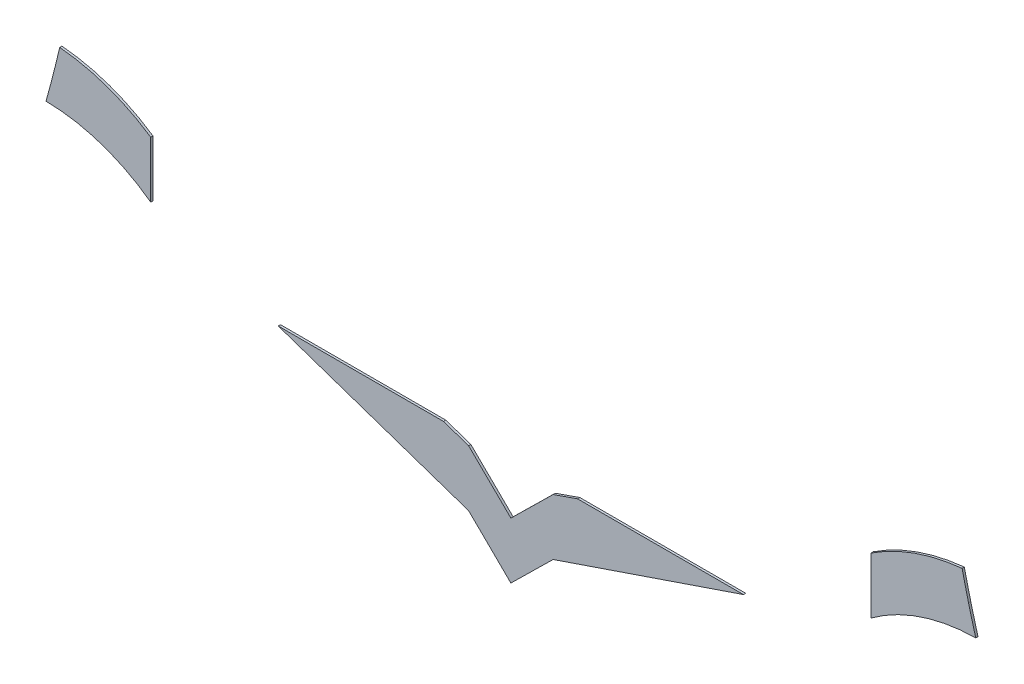
ISO-10303-21;
HEADER;
FILE_DESCRIPTION(('STEP AP214'),'2;1');
FILE_NAME('part.step','',(''),(''),'','','');
FILE_SCHEMA(('AUTOMOTIVE_DESIGN { 1 0 10303 214 1 1 1 1 }'));
ENDSEC;
DATA;
#1=APPLICATION_CONTEXT('core data for automotive mechanical design processes');
#2=APPLICATION_PROTOCOL_DEFINITION('international standard','automotive_design',2000,#1);
#3=PRODUCT_CONTEXT('',#1,'mechanical');
#4=PRODUCT('Part','Part','',(#3));
#5=PRODUCT_RELATED_PRODUCT_CATEGORY('part','',(#4));
#6=PRODUCT_DEFINITION_FORMATION('','',#4);
#7=PRODUCT_DEFINITION_CONTEXT('part definition',#1,'design');
#8=PRODUCT_DEFINITION('design','',#6,#7);
#9=PRODUCT_DEFINITION_SHAPE('','',#8);
#10=(LENGTH_UNIT() NAMED_UNIT(*) SI_UNIT(.MILLI.,.METRE.));
#11=(NAMED_UNIT(*) PLANE_ANGLE_UNIT() SI_UNIT($,.RADIAN.));
#12=(NAMED_UNIT(*) SI_UNIT($,.STERADIAN.) SOLID_ANGLE_UNIT());
#13=UNCERTAINTY_MEASURE_WITH_UNIT(LENGTH_MEASURE(1.E-05),#10,'distance_accuracy_value','');
#14=(GEOMETRIC_REPRESENTATION_CONTEXT(3) GLOBAL_UNCERTAINTY_ASSIGNED_CONTEXT((#13)) GLOBAL_UNIT_ASSIGNED_CONTEXT((#10,
#11,#12)) REPRESENTATION_CONTEXT('',''));
#15=CARTESIAN_POINT('',(0.,0.,0.));
#16=DIRECTION('',(0.,0.,1.));
#17=DIRECTION('',(1.,0.,0.));
#18=AXIS2_PLACEMENT_3D('',#15,#16,#17);
#19=CARTESIAN_POINT('',(105.255595156182,0.273340323345451,0.1));
#20=DIRECTION('',(0.,0.,-1.));
#21=DIRECTION('',(-1.,0.,0.));
#22=AXIS2_PLACEMENT_3D('',#19,#20,#21);
#23=CYLINDRICAL_SURFACE('',#22,49.5565467450276);
#24=CARTESIAN_POINT('',(105.255595156182,0.273340323345451,0.));
#25=DIRECTION('',(0.,0.,1.));
#26=DIRECTION('',(1.,0.,0.));
#27=AXIS2_PLACEMENT_3D('',#24,#25,#26);
#28=CIRCLE('',#27,49.5565467450276);
#29=CARTESIAN_POINT('',(57.2392618978318,-11.9856590532401,0.));
#30=VERTEX_POINT('',#29);
#31=CARTESIAN_POINT('',(57.5596268433982,-13.1782741521736,0.));
#32=VERTEX_POINT('',#31);
#33=EDGE_CURVE('E117',#30,#32,#28,.T.);
#34=ORIENTED_EDGE('',*,*,#33,.F.);
#35=DIRECTION('',(0.,0.,-1.));
#36=VECTOR('',#35,1.);
#37=CARTESIAN_POINT('',(57.2392618978318,-11.9856590532401,0.1));
#38=LINE('',#37,#36);
#39=CARTESIAN_POINT('',(57.2392618978318,-11.9856590532401,0.1));
#40=VERTEX_POINT('',#39);
#41=EDGE_CURVE('E12',#40,#30,#38,.T.);
#42=ORIENTED_EDGE('',*,*,#41,.F.);
#43=CARTESIAN_POINT('',(105.255595156182,0.273340323345451,0.1));
#44=DIRECTION('',(0.,0.,1.));
#45=DIRECTION('',(1.,0.,0.));
#46=AXIS2_PLACEMENT_3D('',#43,#44,#45);
#47=CIRCLE('',#46,49.5565467450276);
#48=CARTESIAN_POINT('',(57.5596268433982,-13.1782741521736,0.1));
#49=VERTEX_POINT('',#48);
#50=EDGE_CURVE('E128',#40,#49,#47,.T.);
#51=ORIENTED_EDGE('',*,*,#50,.T.);
#52=DIRECTION('',(0.,0.,-1.));
#53=VECTOR('',#52,1.);
#54=CARTESIAN_POINT('',(57.5596268433982,-13.1782741521736,0.1));
#55=LINE('',#54,#53);
#56=EDGE_CURVE('E60',#49,#32,#55,.T.);
#57=ORIENTED_EDGE('',*,*,#56,.T.);
#58=EDGE_LOOP('',(#34,#42,#51,#57));
#59=FACE_BOUND('',#58,.T.);
#60=ADVANCED_FACE('F44',(#59),#23,.F.);
#61=CARTESIAN_POINT('',(105.838872329253,0.417414248116804,0.1));
#62=DIRECTION('',(0.,0.,-1.));
#63=DIRECTION('',(-1.,0.,0.));
#64=AXIS2_PLACEMENT_3D('',#61,#62,#63);
#65=CYLINDRICAL_SURFACE('',#64,50.1573360676653);
#66=CARTESIAN_POINT('',(105.838872329253,0.417414248116804,0.));
#67=DIRECTION('',(0.,0.,1.));
#68=DIRECTION('',(1.,0.,0.));
#69=AXIS2_PLACEMENT_3D('',#66,#67,#68);
#70=CIRCLE('',#69,50.1573360676653);
#71=CARTESIAN_POINT('',(56.9528956158932,-10.803977919773,0.));
#72=VERTEX_POINT('',#71);
#73=EDGE_CURVE('E119',#72,#30,#70,.T.);
#74=ORIENTED_EDGE('',*,*,#73,.F.);
#75=DIRECTION('',(0.,0.,-1.));
#76=VECTOR('',#75,1.);
#77=CARTESIAN_POINT('',(56.9528956158932,-10.803977919773,0.1));
#78=LINE('',#77,#76);
#79=CARTESIAN_POINT('',(56.9528956158932,-10.803977919773,0.1));
#80=VERTEX_POINT('',#79);
#81=EDGE_CURVE('E52',#80,#72,#78,.T.);
#82=ORIENTED_EDGE('',*,*,#81,.F.);
#83=CARTESIAN_POINT('',(105.838872329253,0.417414248116804,0.1));
#84=DIRECTION('',(0.,0.,1.));
#85=DIRECTION('',(1.,0.,0.));
#86=AXIS2_PLACEMENT_3D('',#83,#84,#85);
#87=CIRCLE('',#86,50.1573360676653);
#88=EDGE_CURVE('E100',#80,#40,#87,.T.);
#89=ORIENTED_EDGE('',*,*,#88,.T.);
#90=ORIENTED_EDGE('',*,*,#41,.T.);
#91=EDGE_LOOP('',(#74,#82,#89,#90));
#92=FACE_BOUND('',#91,.T.);
#93=ADVANCED_FACE('F134',(#92),#65,.F.);
#94=CARTESIAN_POINT('',(57.8516246009615,-19.7603169013723,0.1));
#95=DIRECTION('',(0.,0.,-1.));
#96=DIRECTION('',(-1.,0.,0.));
#97=AXIS2_PLACEMENT_3D('',#94,#95,#96);
#98=CYLINDRICAL_SURFACE('',#97,9.00131777807657);
#99=CARTESIAN_POINT('',(57.8516246009615,-19.7603169013723,0.));
#100=DIRECTION('',(0.,0.,1.));
#101=DIRECTION('',(1.,0.,0.));
#102=AXIS2_PLACEMENT_3D('',#99,#100,#101);
#103=CIRCLE('',#102,9.00131777807657);
#104=CARTESIAN_POINT('',(52.9070512570531,-12.2386870122706,0.));
#105=VERTEX_POINT('',#104);
#106=EDGE_CURVE('E107',#72,#105,#103,.T.);
#107=ORIENTED_EDGE('',*,*,#106,.T.);
#108=DIRECTION('',(0.,0.,-1.));
#109=VECTOR('',#108,1.);
#110=CARTESIAN_POINT('',(52.9070512570531,-12.2386870122706,0.1));
#111=LINE('',#110,#109);
#112=CARTESIAN_POINT('',(52.9070512570531,-12.2386870122706,0.1));
#113=VERTEX_POINT('',#112);
#114=EDGE_CURVE('E104',#113,#105,#111,.T.);
#115=ORIENTED_EDGE('',*,*,#114,.F.);
#116=CARTESIAN_POINT('',(57.8516246009615,-19.7603169013723,0.1));
#117=DIRECTION('',(0.,0.,1.));
#118=DIRECTION('',(1.,0.,0.));
#119=AXIS2_PLACEMENT_3D('',#116,#117,#118);
#120=CIRCLE('',#119,9.00131777807657);
#121=EDGE_CURVE('E93',#80,#113,#120,.T.);
#122=ORIENTED_EDGE('',*,*,#121,.F.);
#123=ORIENTED_EDGE('',*,*,#81,.T.);
#124=EDGE_LOOP('',(#107,#115,#122,#123));
#125=FACE_BOUND('',#124,.T.);
#126=ADVANCED_FACE('F105',(#125),#98,.T.);
#127=CARTESIAN_POINT('',(52.9070512570531,0.,0.1));
#128=DIRECTION('',(1.,0.,0.));
#129=DIRECTION('',(0.,0.,-1.));
#130=AXIS2_PLACEMENT_3D('',#127,#128,#129);
#131=PLANE('',#130);
#132=DIRECTION('',(0.,-1.,0.));
#133=VECTOR('',#132,1.);
#134=CARTESIAN_POINT('',(52.9070512570531,0.,0.));
#135=LINE('',#134,#133);
#136=CARTESIAN_POINT('',(52.9070512570531,-14.7408716116207,0.));
#137=VERTEX_POINT('',#136);
#138=EDGE_CURVE('E123',#105,#137,#135,.T.);
#139=ORIENTED_EDGE('',*,*,#138,.T.);
#140=DIRECTION('',(0.,0.,-1.));
#141=VECTOR('',#140,1.);
#142=CARTESIAN_POINT('',(52.9070512570531,-14.7408716116207,0.1));
#143=LINE('',#142,#141);
#144=CARTESIAN_POINT('',(52.9070512570531,-14.7408716116207,0.1));
#145=VERTEX_POINT('',#144);
#146=EDGE_CURVE('E77',#145,#137,#143,.T.);
#147=ORIENTED_EDGE('',*,*,#146,.F.);
#148=DIRECTION('',(0.,-1.,0.));
#149=VECTOR('',#148,1.);
#150=CARTESIAN_POINT('',(52.9070512570531,0.,0.1));
#151=LINE('',#150,#149);
#152=EDGE_CURVE('E98',#113,#145,#151,.T.);
#153=ORIENTED_EDGE('',*,*,#152,.F.);
#154=ORIENTED_EDGE('',*,*,#114,.T.);
#155=EDGE_LOOP('',(#139,#147,#153,#154));
#156=FACE_BOUND('',#155,.T.);
#157=ADVANCED_FACE('F111',(#156),#131,.F.);
#158=CARTESIAN_POINT('',(57.655479277362,-21.1714049627363,0.1));
#159=DIRECTION('',(0.,0.,-1.));
#160=DIRECTION('',(-1.,0.,0.));
#161=AXIS2_PLACEMENT_3D('',#158,#159,#160);
#162=CYLINDRICAL_SURFACE('',#161,7.99370551395687);
#163=CARTESIAN_POINT('',(57.655479277362,-21.1714049627363,0.));
#164=DIRECTION('',(0.,0.,1.));
#165=DIRECTION('',(1.,0.,0.));
#166=AXIS2_PLACEMENT_3D('',#163,#164,#165);
#167=CIRCLE('',#166,7.99370551395687);
#168=EDGE_CURVE('E125',#32,#137,#167,.T.);
#169=ORIENTED_EDGE('',*,*,#168,.F.);
#170=ORIENTED_EDGE('',*,*,#56,.F.);
#171=CARTESIAN_POINT('',(57.655479277362,-21.1714049627363,0.1));
#172=DIRECTION('',(0.,0.,1.));
#173=DIRECTION('',(1.,0.,0.));
#174=AXIS2_PLACEMENT_3D('',#171,#172,#173);
#175=CIRCLE('',#174,7.99370551395687);
#176=EDGE_CURVE('E112',#49,#145,#175,.T.);
#177=ORIENTED_EDGE('',*,*,#176,.T.);
#178=ORIENTED_EDGE('',*,*,#146,.T.);
#179=EDGE_LOOP('',(#169,#170,#177,#178));
#180=FACE_BOUND('',#179,.T.);
#181=ADVANCED_FACE('F135',(#180),#162,.F.);
#182=CARTESIAN_POINT('',(0.,0.,0.1));
#183=DIRECTION('',(0.,0.,1.));
#184=DIRECTION('',(1.,0.,0.));
#185=AXIS2_PLACEMENT_3D('',#182,#183,#184);
#186=PLANE('',#185);
#187=ORIENTED_EDGE('',*,*,#50,.F.);
#188=ORIENTED_EDGE('',*,*,#88,.F.);
#189=ORIENTED_EDGE('',*,*,#121,.T.);
#190=ORIENTED_EDGE('',*,*,#152,.T.);
#191=ORIENTED_EDGE('',*,*,#176,.F.);
#192=EDGE_LOOP('',(#187,#188,#189,#190,#191));
#193=FACE_BOUND('',#192,.T.);
#194=ADVANCED_FACE('F95',(#193),#186,.T.);
#195=CARTESIAN_POINT('',(0.,0.,0.));
#196=DIRECTION('',(0.,0.,1.));
#197=DIRECTION('',(1.,0.,0.));
#198=AXIS2_PLACEMENT_3D('',#195,#196,#197);
#199=PLANE('',#198);
#200=ORIENTED_EDGE('',*,*,#33,.T.);
#201=ORIENTED_EDGE('',*,*,#168,.T.);
#202=ORIENTED_EDGE('',*,*,#138,.F.);
#203=ORIENTED_EDGE('',*,*,#106,.F.);
#204=ORIENTED_EDGE('',*,*,#73,.T.);
#205=EDGE_LOOP('',(#200,#201,#202,#203,#204));
#206=FACE_BOUND('',#205,.T.);
#207=ADVANCED_FACE('F133',(#206),#199,.F.);
#208=CLOSED_SHELL('',(#60,#93,#126,#157,#181,#194,#207));
#209=MANIFOLD_SOLID_BREP('B2',#208);
#210=CARTESIAN_POINT('',(9.99420137721838,-29.3523144183627,0.1));
#211=DIRECTION('',(0.322319407031815,-0.946630973426635,0.));
#212=DIRECTION('',(0.946630973426635,0.322319407031815,0.));
#213=AXIS2_PLACEMENT_3D('',#210,#211,#212);
#214=PLANE('',#213);
#215=DIRECTION('',(-0.946630973426636,-0.322319407031815,0.));
#216=VECTOR('',#215,1.);
#217=CARTESIAN_POINT('',(9.99420137721838,-29.3523144183627,0.));
#218=LINE('',#217,#216);
#219=CARTESIAN_POINT('',(47.2390911432918,-16.6707614992658,0.));
#220=VERTEX_POINT('',#219);
#221=CARTESIAN_POINT('',(38.7822885700879,-19.550227381217,0.));
#222=VERTEX_POINT('',#221);
#223=EDGE_CURVE('E309',#220,#222,#218,.T.);
#224=ORIENTED_EDGE('',*,*,#223,.F.);
#225=DIRECTION('',(0.,0.,-1.));
#226=VECTOR('',#225,1.);
#227=CARTESIAN_POINT('',(47.2390911432918,-16.6707614992658,0.1));
#228=LINE('',#227,#226);
#229=CARTESIAN_POINT('',(47.2390911432918,-16.6707614992658,0.1));
#230=VERTEX_POINT('',#229);
#231=EDGE_CURVE('E42',#230,#220,#228,.T.);
#232=ORIENTED_EDGE('',*,*,#231,.F.);
#233=DIRECTION('',(-0.946630973426636,-0.322319407031815,0.));
#234=VECTOR('',#233,1.);
#235=CARTESIAN_POINT('',(9.99420137721838,-29.3523144183627,0.1));
#236=LINE('',#235,#234);
#237=CARTESIAN_POINT('',(38.7822885700879,-19.550227381217,0.1));
#238=VERTEX_POINT('',#237);
#239=EDGE_CURVE('E329',#230,#238,#236,.T.);
#240=ORIENTED_EDGE('',*,*,#239,.T.);
#241=DIRECTION('',(0.,0.,-1.));
#242=VECTOR('',#241,1.);
#243=CARTESIAN_POINT('',(38.7822885700879,-19.550227381217,0.1));
#244=LINE('',#243,#242);
#245=EDGE_CURVE('E219',#238,#222,#244,.T.);
#246=ORIENTED_EDGE('',*,*,#245,.T.);
#247=EDGE_LOOP('',(#224,#232,#240,#246));
#248=FACE_BOUND('',#247,.T.);
#249=ADVANCED_FACE('F203',(#248),#214,.T.);
#250=CARTESIAN_POINT('',(0.,-16.6707614992658,0.1));
#251=DIRECTION('',(0.,-1.,0.));
#252=DIRECTION('',(1.,0.,0.));
#253=AXIS2_PLACEMENT_3D('',#250,#251,#252);
#254=PLANE('',#253);
#255=DIRECTION('',(-1.,0.,0.));
#256=VECTOR('',#255,1.);
#257=CARTESIAN_POINT('',(0.,-16.6707614992658,0.));
#258=LINE('',#257,#256);
#259=CARTESIAN_POINT('',(39.8707967665325,-16.6707614992658,0.));
#260=VERTEX_POINT('',#259);
#261=EDGE_CURVE('E311',#220,#260,#258,.T.);
#262=ORIENTED_EDGE('',*,*,#261,.T.);
#263=DIRECTION('',(0.,0.,-1.));
#264=VECTOR('',#263,1.);
#265=CARTESIAN_POINT('',(39.8707967665325,-16.6707614992658,0.1));
#266=LINE('',#265,#264);
#267=CARTESIAN_POINT('',(39.8707967665325,-16.6707614992658,0.1));
#268=VERTEX_POINT('',#267);
#269=EDGE_CURVE('E211',#268,#260,#266,.T.);
#270=ORIENTED_EDGE('',*,*,#269,.F.);
#271=DIRECTION('',(-1.,0.,0.));
#272=VECTOR('',#271,1.);
#273=CARTESIAN_POINT('',(0.,-16.6707614992658,0.1));
#274=LINE('',#273,#272);
#275=EDGE_CURVE('E376',#230,#268,#274,.T.);
#276=ORIENTED_EDGE('',*,*,#275,.F.);
#277=ORIENTED_EDGE('',*,*,#231,.T.);
#278=EDGE_LOOP('',(#262,#270,#276,#277));
#279=FACE_BOUND('',#278,.T.);
#280=ADVANCED_FACE('F389',(#279),#254,.F.);
#281=CARTESIAN_POINT('',(9.50228331858357,-27.257557976051,0.1));
#282=DIRECTION('',(0.329181682712165,-0.944266604178496,0.));
#283=DIRECTION('',(0.944266604178496,0.329181682712165,0.));
#284=AXIS2_PLACEMENT_3D('',#281,#282,#283);
#285=PLANE('',#284);
#286=DIRECTION('',(-0.944266604178496,-0.329181682712165,0.));
#287=VECTOR('',#286,1.);
#288=CARTESIAN_POINT('',(9.50228331858357,-27.257557976051,0.));
#289=LINE('',#288,#287);
#290=CARTESIAN_POINT('',(38.7822885700879,-17.050227381217,0.));
#291=VERTEX_POINT('',#290);
#292=EDGE_CURVE('E313',#260,#291,#289,.T.);
#293=ORIENTED_EDGE('',*,*,#292,.T.);
#294=DIRECTION('',(0.,0.,-1.));
#295=VECTOR('',#294,1.);
#296=CARTESIAN_POINT('',(38.7822885700879,-17.050227381217,0.1));
#297=LINE('',#296,#295);
#298=CARTESIAN_POINT('',(38.7822885700879,-17.050227381217,0.1));
#299=VERTEX_POINT('',#298);
#300=EDGE_CURVE('E342',#299,#291,#297,.T.);
#301=ORIENTED_EDGE('',*,*,#300,.F.);
#302=DIRECTION('',(-0.944266604178496,-0.329181682712165,0.));
#303=VECTOR('',#302,1.);
#304=CARTESIAN_POINT('',(9.50228331858357,-27.257557976051,0.1));
#305=LINE('',#304,#303);
#306=EDGE_CURVE('E351',#268,#299,#305,.T.);
#307=ORIENTED_EDGE('',*,*,#306,.F.);
#308=ORIENTED_EDGE('',*,*,#269,.T.);
#309=EDGE_LOOP('',(#293,#301,#307,#308));
#310=FACE_BOUND('',#309,.T.);
#311=ADVANCED_FACE('F349',(#310),#285,.F.);
#312=CARTESIAN_POINT('',(27.5878765181608,-28.0573337595043,0.1));
#313=DIRECTION('',(0.701116242134741,-0.713046993552921,0.));
#314=DIRECTION('',(0.713046993552921,0.701116242134741,0.));
#315=AXIS2_PLACEMENT_3D('',#312,#313,#314);
#316=PLANE('',#315);
#317=DIRECTION('',(-0.713046993552921,-0.701116242134741,0.));
#318=VECTOR('',#317,1.);
#319=CARTESIAN_POINT('',(27.5878765181608,-28.0573337595043,0.));
#320=LINE('',#319,#318);
#321=CARTESIAN_POINT('',(36.9069299269056,-18.8942073943874,0.));
#322=VERTEX_POINT('',#321);
#323=EDGE_CURVE('E315',#291,#322,#320,.T.);
#324=ORIENTED_EDGE('',*,*,#323,.T.);
#325=DIRECTION('',(0.,0.,-1.));
#326=VECTOR('',#325,1.);
#327=CARTESIAN_POINT('',(36.9069299269056,-18.8942073943874,0.1));
#328=LINE('',#327,#326);
#329=CARTESIAN_POINT('',(36.9069299269056,-18.8942073943874,0.1));
#330=VERTEX_POINT('',#329);
#331=EDGE_CURVE('E339',#330,#322,#328,.T.);
#332=ORIENTED_EDGE('',*,*,#331,.F.);
#333=DIRECTION('',(-0.713046993552921,-0.701116242134741,0.));
#334=VECTOR('',#333,1.);
#335=CARTESIAN_POINT('',(27.5878765181608,-28.0573337595043,0.1));
#336=LINE('',#335,#334);
#337=EDGE_CURVE('E370',#299,#330,#336,.T.);
#338=ORIENTED_EDGE('',*,*,#337,.F.);
#339=ORIENTED_EDGE('',*,*,#300,.T.);
#340=EDGE_LOOP('',(#324,#332,#338,#339));
#341=FACE_BOUND('',#340,.T.);
#342=ADVANCED_FACE('F361',(#341),#316,.F.);
#343=CARTESIAN_POINT('',(8.6928837462616,8.84248874565546,0.1));
#344=DIRECTION('',(-0.701048506646403,-0.713113589359261,0.));
#345=DIRECTION('',(0.713113589359261,-0.701048506646403,0.));
#346=AXIS2_PLACEMENT_3D('',#343,#344,#345);
#347=PLANE('',#346);
#348=DIRECTION('',(-0.713113589359261,0.701048506646403,0.));
#349=VECTOR('',#348,1.);
#350=CARTESIAN_POINT('',(8.6928837462616,8.84248874565546,0.));
#351=LINE('',#350,#349);
#352=CARTESIAN_POINT('',(35.0313961325451,-17.0504055298308,0.));
#353=VERTEX_POINT('',#352);
#354=EDGE_CURVE('E317',#322,#353,#351,.T.);
#355=ORIENTED_EDGE('',*,*,#354,.T.);
#356=DIRECTION('',(0.,0.,-1.));
#357=VECTOR('',#356,1.);
#358=CARTESIAN_POINT('',(35.0313961325451,-17.0504055298308,0.1));
#359=LINE('',#358,#357);
#360=CARTESIAN_POINT('',(35.0313961325451,-17.0504055298308,0.1));
#361=VERTEX_POINT('',#360);
#362=EDGE_CURVE('E336',#361,#353,#359,.T.);
#363=ORIENTED_EDGE('',*,*,#362,.F.);
#364=DIRECTION('',(-0.713113589359261,0.701048506646403,0.));
#365=VECTOR('',#364,1.);
#366=CARTESIAN_POINT('',(8.6928837462616,8.84248874565546,0.1));
#367=LINE('',#366,#365);
#368=EDGE_CURVE('E367',#330,#361,#367,.T.);
#369=ORIENTED_EDGE('',*,*,#368,.F.);
#370=ORIENTED_EDGE('',*,*,#331,.T.);
#371=EDGE_LOOP('',(#355,#363,#369,#370));
#372=FACE_BOUND('',#371,.T.);
#373=ADVANCED_FACE('F365',(#372),#347,.F.);
#374=CARTESIAN_POINT('',(-1.56372014546052,-4.59397374162848,0.1));
#375=DIRECTION('',(-0.322229485113041,-0.946661586272404,0.));
#376=DIRECTION('',(0.946661586272404,-0.322229485113041,0.));
#377=AXIS2_PLACEMENT_3D('',#374,#375,#376);
#378=PLANE('',#377);
#379=DIRECTION('',(-0.946661586272404,0.322229485113041,0.));
#380=VECTOR('',#379,1.);
#381=CARTESIAN_POINT('',(-1.56372014546052,-4.59397374162848,0.));
#382=LINE('',#381,#380);
#383=CARTESIAN_POINT('',(33.9160592785405,-16.6707614992658,0.));
#384=VERTEX_POINT('',#383);
#385=EDGE_CURVE('E319',#353,#384,#382,.T.);
#386=ORIENTED_EDGE('',*,*,#385,.T.);
#387=DIRECTION('',(0.,0.,-1.));
#388=VECTOR('',#387,1.);
#389=CARTESIAN_POINT('',(33.9160592785405,-16.6707614992658,0.1));
#390=LINE('',#389,#388);
#391=CARTESIAN_POINT('',(33.9160592785405,-16.6707614992658,0.1));
#392=VERTEX_POINT('',#391);
#393=EDGE_CURVE('E333',#392,#384,#390,.T.);
#394=ORIENTED_EDGE('',*,*,#393,.F.);
#395=DIRECTION('',(-0.946661586272404,0.322229485113041,0.));
#396=VECTOR('',#395,1.);
#397=CARTESIAN_POINT('',(-1.56372014546052,-4.59397374162848,0.1));
#398=LINE('',#397,#396);
#399=EDGE_CURVE('E369',#361,#392,#398,.T.);
#400=ORIENTED_EDGE('',*,*,#399,.F.);
#401=ORIENTED_EDGE('',*,*,#362,.T.);
#402=EDGE_LOOP('',(#386,#394,#400,#401));
#403=FACE_BOUND('',#402,.T.);
#404=ADVANCED_FACE('F402',(#403),#378,.F.);
#405=CARTESIAN_POINT('',(0.,-16.6707614992658,0.1));
#406=DIRECTION('',(0.,-1.,0.));
#407=DIRECTION('',(0.,0.,-1.));
#408=AXIS2_PLACEMENT_3D('',#405,#406,#407);
#409=PLANE('',#408);
#410=DIRECTION('',(-1.,0.,0.));
#411=VECTOR('',#410,1.);
#412=CARTESIAN_POINT('',(0.,-16.6707614992658,0.));
#413=LINE('',#412,#411);
#414=CARTESIAN_POINT('',(26.5716741651286,-16.6707614992658,0.));
#415=VERTEX_POINT('',#414);
#416=EDGE_CURVE('E321',#384,#415,#413,.T.);
#417=ORIENTED_EDGE('',*,*,#416,.T.);
#418=DIRECTION('',(0.,0.,-1.));
#419=VECTOR('',#418,1.);
#420=CARTESIAN_POINT('',(26.5716741651286,-16.6707614992658,0.1));
#421=LINE('',#420,#419);
#422=CARTESIAN_POINT('',(26.5716741651286,-16.6707614992658,0.1));
#423=VERTEX_POINT('',#422);
#424=EDGE_CURVE('E301',#423,#415,#421,.T.);
#425=ORIENTED_EDGE('',*,*,#424,.F.);
#426=DIRECTION('',(-1.,0.,0.));
#427=VECTOR('',#426,1.);
#428=CARTESIAN_POINT('',(0.,-16.6707614992658,0.1));
#429=LINE('',#428,#427);
#430=EDGE_CURVE('E289',#392,#423,#429,.T.);
#431=ORIENTED_EDGE('',*,*,#430,.F.);
#432=ORIENTED_EDGE('',*,*,#393,.T.);
#433=EDGE_LOOP('',(#417,#425,#431,#432));
#434=FACE_BOUND('',#433,.T.);
#435=ADVANCED_FACE('F405',(#434),#409,.F.);
#436=CARTESIAN_POINT('',(-2.32630117335883,-6.83432168892512,0.1));
#437=DIRECTION('',(0.32222948511304,0.946661586272404,0.));
#438=DIRECTION('',(-0.946661586272405,0.32222948511304,0.));
#439=AXIS2_PLACEMENT_3D('',#436,#437,#438);
#440=PLANE('',#439);
#441=DIRECTION('',(0.946661586272404,-0.32222948511304,0.));
#442=VECTOR('',#441,1.);
#443=CARTESIAN_POINT('',(-2.32630117335883,-6.83432168892512,0.));
#444=LINE('',#443,#442);
#445=CARTESIAN_POINT('',(35.0316336075146,-19.5504055185519,0.));
#446=VERTEX_POINT('',#445);
#447=EDGE_CURVE('E298',#415,#446,#444,.T.);
#448=ORIENTED_EDGE('',*,*,#447,.T.);
#449=DIRECTION('',(0.,0.,-1.));
#450=VECTOR('',#449,1.);
#451=CARTESIAN_POINT('',(35.0316336075146,-19.5504055185519,0.1));
#452=LINE('',#451,#450);
#453=CARTESIAN_POINT('',(35.0316336075146,-19.5504055185519,0.1));
#454=VERTEX_POINT('',#453);
#455=EDGE_CURVE('E295',#454,#446,#452,.T.);
#456=ORIENTED_EDGE('',*,*,#455,.F.);
#457=DIRECTION('',(0.946661586272404,-0.32222948511304,0.));
#458=VECTOR('',#457,1.);
#459=CARTESIAN_POINT('',(-2.32630117335883,-6.83432168892512,0.1));
#460=LINE('',#459,#458);
#461=EDGE_CURVE('E281',#423,#454,#460,.T.);
#462=ORIENTED_EDGE('',*,*,#461,.F.);
#463=ORIENTED_EDGE('',*,*,#424,.T.);
#464=EDGE_LOOP('',(#448,#456,#462,#463));
#465=FACE_BOUND('',#464,.T.);
#466=ADVANCED_FACE('F296',(#465),#440,.F.);
#467=CARTESIAN_POINT('',(7.44318242126414,7.57127999326957,0.1));
#468=DIRECTION('',(0.701048506646403,0.713113589359261,0.));
#469=DIRECTION('',(-0.713113589359261,0.701048506646403,0.));
#470=AXIS2_PLACEMENT_3D('',#467,#468,#469);
#471=PLANE('',#470);
#472=DIRECTION('',(0.713113589359261,-0.701048506646403,0.));
#473=VECTOR('',#472,1.);
#474=CARTESIAN_POINT('',(7.44318242126414,7.57127999326957,0.));
#475=LINE('',#474,#473);
#476=CARTESIAN_POINT('',(36.9071674018751,-21.3942073831086,0.));
#477=VERTEX_POINT('',#476);
#478=EDGE_CURVE('E324',#446,#477,#475,.T.);
#479=ORIENTED_EDGE('',*,*,#478,.T.);
#480=DIRECTION('',(0.,0.,-1.));
#481=VECTOR('',#480,1.);
#482=CARTESIAN_POINT('',(36.9071674018751,-21.3942073831086,0.1));
#483=LINE('',#482,#481);
#484=CARTESIAN_POINT('',(36.9071674018751,-21.3942073831086,0.1));
#485=VERTEX_POINT('',#484);
#486=EDGE_CURVE('E251',#485,#477,#483,.T.);
#487=ORIENTED_EDGE('',*,*,#486,.F.);
#488=DIRECTION('',(0.713113589359261,-0.701048506646403,0.));
#489=VECTOR('',#488,1.);
#490=CARTESIAN_POINT('',(7.44318242126414,7.57127999326957,0.1));
#491=LINE('',#490,#489);
#492=EDGE_CURVE('E287',#454,#485,#491,.T.);
#493=ORIENTED_EDGE('',*,*,#492,.F.);
#494=ORIENTED_EDGE('',*,*,#455,.T.);
#495=EDGE_LOOP('',(#479,#487,#493,#494));
#496=FACE_BOUND('',#495,.T.);
#497=ADVANCED_FACE('F303',(#496),#471,.F.);
#498=CARTESIAN_POINT('',(28.840174219251,-29.3272275827219,0.1));
#499=DIRECTION('',(0.701161381277546,-0.713002606871086,0.));
#500=DIRECTION('',(0.713002606871086,0.701161381277546,0.));
#501=AXIS2_PLACEMENT_3D('',#498,#499,#500);
#502=PLANE('',#501);
#503=DIRECTION('',(-0.713002606871086,-0.701161381277546,0.));
#504=VECTOR('',#503,1.);
#505=CARTESIAN_POINT('',(28.840174219251,-29.3272275827219,0.));
#506=LINE('',#505,#504);
#507=EDGE_CURVE('E326',#222,#477,#506,.T.);
#508=ORIENTED_EDGE('',*,*,#507,.F.);
#509=ORIENTED_EDGE('',*,*,#245,.F.);
#510=DIRECTION('',(-0.713002606871086,-0.701161381277546,0.));
#511=VECTOR('',#510,1.);
#512=CARTESIAN_POINT('',(28.840174219251,-29.3272275827219,0.1));
#513=LINE('',#512,#511);
#514=EDGE_CURVE('E304',#238,#485,#513,.T.);
#515=ORIENTED_EDGE('',*,*,#514,.T.);
#516=ORIENTED_EDGE('',*,*,#486,.T.);
#517=EDGE_LOOP('',(#508,#509,#515,#516));
#518=FACE_BOUND('',#517,.T.);
#519=ADVANCED_FACE('F378',(#518),#502,.T.);
#520=CARTESIAN_POINT('',(0.,0.,0.1));
#521=DIRECTION('',(0.,0.,1.));
#522=DIRECTION('',(1.,0.,0.));
#523=AXIS2_PLACEMENT_3D('',#520,#521,#522);
#524=PLANE('',#523);
#525=ORIENTED_EDGE('',*,*,#239,.F.);
#526=ORIENTED_EDGE('',*,*,#275,.T.);
#527=ORIENTED_EDGE('',*,*,#306,.T.);
#528=ORIENTED_EDGE('',*,*,#337,.T.);
#529=ORIENTED_EDGE('',*,*,#368,.T.);
#530=ORIENTED_EDGE('',*,*,#399,.T.);
#531=ORIENTED_EDGE('',*,*,#430,.T.);
#532=ORIENTED_EDGE('',*,*,#461,.T.);
#533=ORIENTED_EDGE('',*,*,#492,.T.);
#534=ORIENTED_EDGE('',*,*,#514,.F.);
#535=EDGE_LOOP('',(#525,#526,#527,#528,#529,#530,#531,#532,#533,#534));
#536=FACE_BOUND('',#535,.T.);
#537=ADVANCED_FACE('F284',(#536),#524,.T.);
#538=CARTESIAN_POINT('',(0.,0.,0.));
#539=DIRECTION('',(0.,0.,1.));
#540=DIRECTION('',(1.,0.,0.));
#541=AXIS2_PLACEMENT_3D('',#538,#539,#540);
#542=PLANE('',#541);
#543=ORIENTED_EDGE('',*,*,#223,.T.);
#544=ORIENTED_EDGE('',*,*,#507,.T.);
#545=ORIENTED_EDGE('',*,*,#478,.F.);
#546=ORIENTED_EDGE('',*,*,#447,.F.);
#547=ORIENTED_EDGE('',*,*,#416,.F.);
#548=ORIENTED_EDGE('',*,*,#385,.F.);
#549=ORIENTED_EDGE('',*,*,#354,.F.);
#550=ORIENTED_EDGE('',*,*,#323,.F.);
#551=ORIENTED_EDGE('',*,*,#292,.F.);
#552=ORIENTED_EDGE('',*,*,#261,.F.);
#553=EDGE_LOOP('',(#543,#544,#545,#546,#547,#548,#549,#550,#551,#552));
#554=FACE_BOUND('',#553,.T.);
#555=ADVANCED_FACE('F356',(#554),#542,.F.);
#556=CLOSED_SHELL('',(#249,#280,#311,#342,#373,#404,#435,#466,#497,#519,#537,#555));
#557=MANIFOLD_SOLID_BREP('B6',#556);
#558=CARTESIAN_POINT('',(-32.4832290074629,0.585922876906455,0.1));
#559=DIRECTION('',(0.,0.,-1.));
#560=DIRECTION('',(-1.,0.,0.));
#561=AXIS2_PLACEMENT_3D('',#558,#559,#560);
#562=CYLINDRICAL_SURFACE('',#561,50.6437994061064);
#563=CARTESIAN_POINT('',(-32.4832290074629,0.585922876906455,0.));
#564=DIRECTION('',(0.,0.,1.));
#565=DIRECTION('',(1.,0.,0.));
#566=AXIS2_PLACEMENT_3D('',#563,#564,#565);
#567=CIRCLE('',#566,50.6437994061064);
#568=CARTESIAN_POINT('',(16.2536901471598,-13.1802359773895,0.));
#569=VERTEX_POINT('',#568);
#570=CARTESIAN_POINT('',(16.8626582068563,-10.806084554518,0.));
#571=VERTEX_POINT('',#570);
#572=EDGE_CURVE('E546',#569,#571,#567,.T.);
#573=ORIENTED_EDGE('',*,*,#572,.F.);
#574=DIRECTION('',(0.,0.,-1.));
#575=VECTOR('',#574,1.);
#576=CARTESIAN_POINT('',(16.2536901471598,-13.1802359773895,0.1));
#577=LINE('',#576,#575);
#578=CARTESIAN_POINT('',(16.2536901471598,-13.1802359773895,0.1));
#579=VERTEX_POINT('',#578);
#580=EDGE_CURVE('E201',#579,#569,#577,.T.);
#581=ORIENTED_EDGE('',*,*,#580,.F.);
#582=CARTESIAN_POINT('',(-32.4832290074629,0.585922876906455,0.1));
#583=DIRECTION('',(0.,0.,1.));
#584=DIRECTION('',(1.,0.,0.));
#585=AXIS2_PLACEMENT_3D('',#582,#583,#584);
#586=CIRCLE('',#585,50.6437994061064);
#587=CARTESIAN_POINT('',(16.8626582068563,-10.806084554518,0.1));
#588=VERTEX_POINT('',#587);
#589=EDGE_CURVE('E540',#579,#588,#586,.T.);
#590=ORIENTED_EDGE('',*,*,#589,.T.);
#591=DIRECTION('',(0.,0.,-1.));
#592=VECTOR('',#591,1.);
#593=CARTESIAN_POINT('',(16.8626582068563,-10.806084554518,0.1));
#594=LINE('',#593,#592);
#595=EDGE_CURVE('E521',#588,#571,#594,.T.);
#596=ORIENTED_EDGE('',*,*,#595,.T.);
#597=EDGE_LOOP('',(#573,#581,#590,#596));
#598=FACE_BOUND('',#597,.T.);
#599=ADVANCED_FACE('F483',(#598),#562,.F.);
#600=CARTESIAN_POINT('',(16.1585969810265,-21.1733758569124,0.1));
#601=DIRECTION('',(0.,0.,-1.));
#602=DIRECTION('',(-1.,0.,0.));
#603=AXIS2_PLACEMENT_3D('',#600,#601,#602);
#604=CYLINDRICAL_SURFACE('',#603,7.99370551395687);
#605=CARTESIAN_POINT('',(16.1585969810265,-21.1733758569124,0.));
#606=DIRECTION('',(0.,0.,1.));
#607=DIRECTION('',(1.,0.,0.));
#608=AXIS2_PLACEMENT_3D('',#605,#606,#607);
#609=CIRCLE('',#608,7.99370551395687);
#610=CARTESIAN_POINT('',(20.9064141436281,-14.7423914816888,0.));
#611=VERTEX_POINT('',#610);
#612=EDGE_CURVE('E534',#611,#569,#609,.T.);
#613=ORIENTED_EDGE('',*,*,#612,.F.);
#614=DIRECTION('',(0.,0.,-1.));
#615=VECTOR('',#614,1.);
#616=CARTESIAN_POINT('',(20.9064141436281,-14.7423914816888,0.1));
#617=LINE('',#616,#615);
#618=CARTESIAN_POINT('',(20.9064141436281,-14.7423914816888,0.1));
#619=VERTEX_POINT('',#618);
#620=EDGE_CURVE('E491',#619,#611,#617,.T.);
#621=ORIENTED_EDGE('',*,*,#620,.F.);
#622=CARTESIAN_POINT('',(16.1585969810265,-21.1733758569124,0.1));
#623=DIRECTION('',(0.,0.,1.));
#624=DIRECTION('',(1.,0.,0.));
#625=AXIS2_PLACEMENT_3D('',#622,#623,#624);
#626=CIRCLE('',#625,7.99370551395687);
#627=EDGE_CURVE('E532',#619,#579,#626,.T.);
#628=ORIENTED_EDGE('',*,*,#627,.T.);
#629=ORIENTED_EDGE('',*,*,#580,.T.);
#630=EDGE_LOOP('',(#613,#621,#628,#629));
#631=FACE_BOUND('',#630,.T.);
#632=ADVANCED_FACE('F530',(#631),#604,.F.);
#633=CARTESIAN_POINT('',(20.9050135754069,0.00198576699332894,0.1));
#634=DIRECTION('',(-0.999999995488451,-9.49899877944187E-05,0.));
#635=DIRECTION('',(9.49899877944187E-05,-0.999999995488451,0.));
#636=AXIS2_PLACEMENT_3D('',#633,#634,#635);
#637=PLANE('',#636);
#638=DIRECTION('',(-9.49899877944188E-05,0.999999995488451,0.));
#639=VECTOR('',#638,1.);
#640=CARTESIAN_POINT('',(20.9050135754069,0.00198576699332894,0.));
#641=LINE('',#640,#639);
#642=CARTESIAN_POINT('',(20.9061764611435,-12.2402068936272,0.));
#643=VERTEX_POINT('',#642);
#644=EDGE_CURVE('E514',#611,#643,#641,.T.);
#645=ORIENTED_EDGE('',*,*,#644,.T.);
#646=DIRECTION('',(0.,0.,-1.));
#647=VECTOR('',#646,1.);
#648=CARTESIAN_POINT('',(20.9061764611435,-12.2402068936272,0.1));
#649=LINE('',#648,#647);
#650=CARTESIAN_POINT('',(20.9061764611435,-12.2402068936272,0.1));
#651=VERTEX_POINT('',#650);
#652=EDGE_CURVE('E535',#651,#643,#649,.T.);
#653=ORIENTED_EDGE('',*,*,#652,.F.);
#654=DIRECTION('',(-9.49899877944188E-05,0.999999995488451,0.));
#655=VECTOR('',#654,1.);
#656=CARTESIAN_POINT('',(20.9050135754069,0.00198576699332894,0.1));
#657=LINE('',#656,#655);
#658=EDGE_CURVE('E536',#619,#651,#657,.T.);
#659=ORIENTED_EDGE('',*,*,#658,.F.);
#660=ORIENTED_EDGE('',*,*,#620,.T.);
#661=EDGE_LOOP('',(#645,#653,#659,#660));
#662=FACE_BOUND('',#661,.T.);
#663=ADVANCED_FACE('F537',(#662),#637,.F.);
#664=CARTESIAN_POINT('',(16.1203271346033,-19.3165179301697,0.1));
#665=DIRECTION('',(0.,0.,-1.));
#666=DIRECTION('',(-1.,0.,0.));
#667=AXIS2_PLACEMENT_3D('',#664,#665,#666);
#668=CYLINDRICAL_SURFACE('',#667,8.54274731349572);
#669=CARTESIAN_POINT('',(16.1203271346033,-19.3165179301697,0.));
#670=DIRECTION('',(0.,0.,1.));
#671=DIRECTION('',(1.,0.,0.));
#672=AXIS2_PLACEMENT_3D('',#669,#670,#671);
#673=CIRCLE('',#672,8.54274731349572);
#674=EDGE_CURVE('E542',#643,#571,#673,.T.);
#675=ORIENTED_EDGE('',*,*,#674,.T.);
#676=ORIENTED_EDGE('',*,*,#595,.F.);
#677=CARTESIAN_POINT('',(16.1203271346033,-19.3165179301697,0.1));
#678=DIRECTION('',(0.,0.,1.));
#679=DIRECTION('',(1.,0.,0.));
#680=AXIS2_PLACEMENT_3D('',#677,#678,#679);
#681=CIRCLE('',#680,8.54274731349572);
#682=EDGE_CURVE('E499',#651,#588,#681,.T.);
#683=ORIENTED_EDGE('',*,*,#682,.F.);
#684=ORIENTED_EDGE('',*,*,#652,.T.);
#685=EDGE_LOOP('',(#675,#676,#683,#684));
#686=FACE_BOUND('',#685,.T.);
#687=ADVANCED_FACE('F555',(#686),#668,.T.);
#688=CARTESIAN_POINT('',(0.,0.,0.1));
#689=DIRECTION('',(0.,0.,1.));
#690=DIRECTION('',(1.,0.,0.));
#691=AXIS2_PLACEMENT_3D('',#688,#689,#690);
#692=PLANE('',#691);
#693=ORIENTED_EDGE('',*,*,#589,.F.);
#694=ORIENTED_EDGE('',*,*,#627,.F.);
#695=ORIENTED_EDGE('',*,*,#658,.T.);
#696=ORIENTED_EDGE('',*,*,#682,.T.);
#697=EDGE_LOOP('',(#693,#694,#695,#696));
#698=FACE_BOUND('',#697,.T.);
#699=ADVANCED_FACE('F539',(#698),#692,.T.);
#700=CARTESIAN_POINT('',(0.,0.,0.));
#701=DIRECTION('',(0.,0.,1.));
#702=DIRECTION('',(1.,0.,0.));
#703=AXIS2_PLACEMENT_3D('',#700,#701,#702);
#704=PLANE('',#703);
#705=ORIENTED_EDGE('',*,*,#572,.T.);
#706=ORIENTED_EDGE('',*,*,#674,.F.);
#707=ORIENTED_EDGE('',*,*,#644,.F.);
#708=ORIENTED_EDGE('',*,*,#612,.T.);
#709=EDGE_LOOP('',(#705,#706,#707,#708));
#710=FACE_BOUND('',#709,.T.);
#711=ADVANCED_FACE('F557',(#710),#704,.F.);
#712=CLOSED_SHELL('',(#599,#632,#663,#687,#699,#711));
#713=MANIFOLD_SOLID_BREP('B36',#712);
#714=ADVANCED_BREP_SHAPE_REPRESENTATION('',(#18,#209,#557,#713),#14);
#715=SHAPE_DEFINITION_REPRESENTATION(#9,#714);
ENDSEC;
END-ISO-10303-21;
